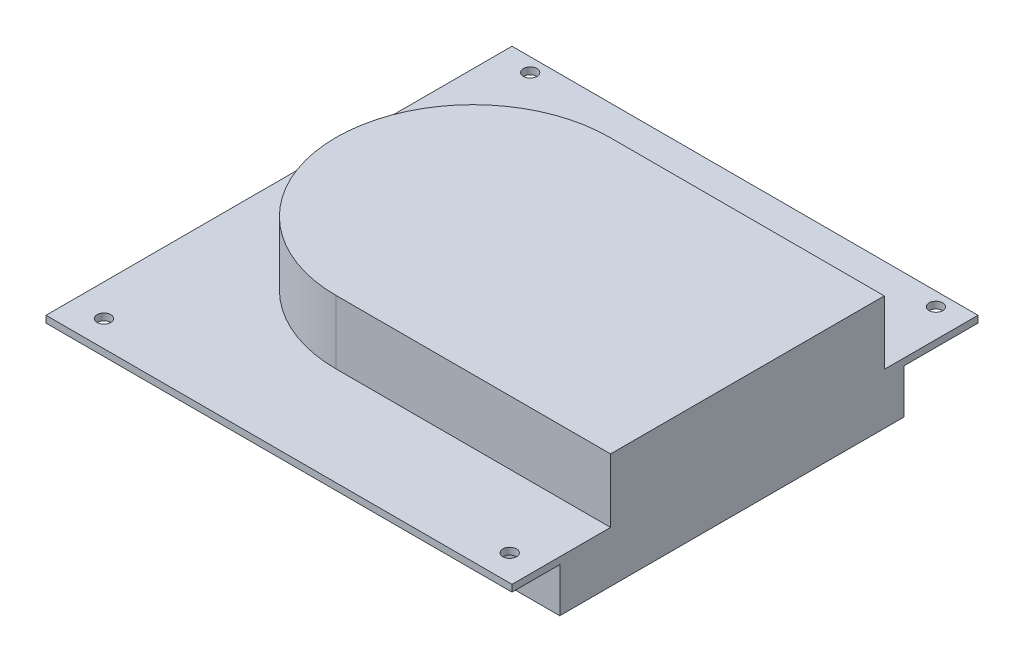
ISO-10303-21;
HEADER;
FILE_DESCRIPTION(('STEP AP214'),'2;1');
FILE_NAME('part.step','',(''),(''),'','','');
FILE_SCHEMA(('AUTOMOTIVE_DESIGN { 1 0 10303 214 1 1 1 1 }'));
ENDSEC;
DATA;
#1=APPLICATION_CONTEXT('core data for automotive mechanical design processes');
#2=APPLICATION_PROTOCOL_DEFINITION('international standard','automotive_design',2000,#1);
#3=PRODUCT_CONTEXT('',#1,'mechanical');
#4=PRODUCT('Part','Part','',(#3));
#5=PRODUCT_RELATED_PRODUCT_CATEGORY('part','',(#4));
#6=PRODUCT_DEFINITION_FORMATION('','',#4);
#7=PRODUCT_DEFINITION_CONTEXT('part definition',#1,'design');
#8=PRODUCT_DEFINITION('design','',#6,#7);
#9=PRODUCT_DEFINITION_SHAPE('','',#8);
#10=(LENGTH_UNIT() NAMED_UNIT(*) SI_UNIT(.MILLI.,.METRE.));
#11=(NAMED_UNIT(*) PLANE_ANGLE_UNIT() SI_UNIT($,.RADIAN.));
#12=(NAMED_UNIT(*) SI_UNIT($,.STERADIAN.) SOLID_ANGLE_UNIT());
#13=UNCERTAINTY_MEASURE_WITH_UNIT(LENGTH_MEASURE(1.E-05),#10,'distance_accuracy_value','');
#14=(GEOMETRIC_REPRESENTATION_CONTEXT(3) GLOBAL_UNCERTAINTY_ASSIGNED_CONTEXT((#13)) GLOBAL_UNIT_ASSIGNED_CONTEXT((#10,
#11,#12)) REPRESENTATION_CONTEXT('',''));
#15=CARTESIAN_POINT('',(0.,0.,0.));
#16=DIRECTION('',(0.,0.,1.));
#17=DIRECTION('',(1.,0.,0.));
#18=AXIS2_PLACEMENT_3D('',#15,#16,#17);
#19=CARTESIAN_POINT('',(0.,0.,0.));
#20=DIRECTION('',(0.,-1.,0.));
#21=DIRECTION('',(0.,0.,-1.));
#22=AXIS2_PLACEMENT_3D('',#19,#20,#21);
#23=PLANE('',#22);
#24=CARTESIAN_POINT('',(7.112,0.,-5.842));
#25=DIRECTION('',(0.,1.,0.));
#26=DIRECTION('',(0.,0.,1.));
#27=AXIS2_PLACEMENT_3D('',#24,#25,#26);
#28=CIRCLE('',#27,1.524);
#29=CARTESIAN_POINT('',(7.112,0.,-4.318));
#30=VERTEX_POINT('',#29);
#31=EDGE_CURVE('E237',#30,#30,#28,.T.);
#32=ORIENTED_EDGE('',*,*,#31,.T.);
#33=EDGE_LOOP('',(#32));
#34=FACE_BOUND('',#33,.T.);
#35=CARTESIAN_POINT('',(7.11200000000001,0.,-101.092));
#36=DIRECTION('',(0.,1.,0.));
#37=DIRECTION('',(0.,0.,1.));
#38=AXIS2_PLACEMENT_3D('',#35,#36,#37);
#39=CIRCLE('',#38,1.524);
#40=CARTESIAN_POINT('',(7.11200000000001,0.,-99.568));
#41=VERTEX_POINT('',#40);
#42=EDGE_CURVE('E249',#41,#41,#39,.T.);
#43=ORIENTED_EDGE('',*,*,#42,.T.);
#44=EDGE_LOOP('',(#43));
#45=FACE_BOUND('',#44,.T.);
#46=CARTESIAN_POINT('',(97.79,0.,-101.092));
#47=DIRECTION('',(0.,1.,0.));
#48=DIRECTION('',(0.,0.,1.));
#49=AXIS2_PLACEMENT_3D('',#46,#47,#48);
#50=CIRCLE('',#49,1.52399999999999);
#51=CARTESIAN_POINT('',(97.79,0.,-99.568));
#52=VERTEX_POINT('',#51);
#53=EDGE_CURVE('E243',#52,#52,#50,.T.);
#54=ORIENTED_EDGE('',*,*,#53,.T.);
#55=EDGE_LOOP('',(#54));
#56=FACE_BOUND('',#55,.T.);
#57=CARTESIAN_POINT('',(97.79,0.,-5.842));
#58=DIRECTION('',(0.,1.,0.));
#59=DIRECTION('',(0.,0.,1.));
#60=AXIS2_PLACEMENT_3D('',#57,#58,#59);
#61=CIRCLE('',#60,1.52399999999999);
#62=CARTESIAN_POINT('',(97.79,0.,-4.31800000000001));
#63=VERTEX_POINT('',#62);
#64=EDGE_CURVE('E233',#63,#63,#61,.T.);
#65=ORIENTED_EDGE('',*,*,#64,.T.);
#66=EDGE_LOOP('',(#65));
#67=FACE_BOUND('',#66,.T.);
#68=DIRECTION('',(0.,0.,1.));
#69=VECTOR('',#68,1.);
#70=CARTESIAN_POINT('',(17.1398172693102,0.,-73.9756008703694));
#71=LINE('',#70,#69);
#72=CARTESIAN_POINT('',(17.1398172693102,0.,-73.9756008703694));
#73=VERTEX_POINT('',#72);
#74=CARTESIAN_POINT('',(17.1398172693102,0.,-22.3799697720892));
#75=VERTEX_POINT('',#74);
#76=EDGE_CURVE('E341',#73,#75,#71,.T.);
#77=ORIENTED_EDGE('',*,*,#76,.F.);
#78=DIRECTION('',(1.,0.,0.));
#79=VECTOR('',#78,1.);
#80=CARTESIAN_POINT('',(0.,0.,-73.9756008703694));
#81=LINE('',#80,#79);
#82=CARTESIAN_POINT('',(0.,0.,-73.9756008703694));
#83=VERTEX_POINT('',#82);
#84=EDGE_CURVE('E345',#83,#73,#81,.T.);
#85=ORIENTED_EDGE('',*,*,#84,.F.);
#86=DIRECTION('',(0.,0.,1.));
#87=VECTOR('',#86,1.);
#88=CARTESIAN_POINT('',(0.,0.,0.));
#89=LINE('',#88,#87);
#90=CARTESIAN_POINT('',(0.,0.,-104.14));
#91=VERTEX_POINT('',#90);
#92=EDGE_CURVE('E170',#91,#83,#89,.T.);
#93=ORIENTED_EDGE('',*,*,#92,.F.);
#94=DIRECTION('',(-1.,0.,0.));
#95=VECTOR('',#94,1.);
#96=CARTESIAN_POINT('',(0.,0.,-104.14));
#97=LINE('',#96,#95);
#98=CARTESIAN_POINT('',(104.14,0.,-104.14));
#99=VERTEX_POINT('',#98);
#100=EDGE_CURVE('E262',#99,#91,#97,.T.);
#101=ORIENTED_EDGE('',*,*,#100,.F.);
#102=DIRECTION('',(0.,0.,-1.));
#103=VECTOR('',#102,1.);
#104=CARTESIAN_POINT('',(104.14,0.,0.));
#105=LINE('',#104,#103);
#106=CARTESIAN_POINT('',(104.14,0.,-87.5501635642877));
#107=VERTEX_POINT('',#106);
#108=EDGE_CURVE('E273',#107,#99,#105,.T.);
#109=ORIENTED_EDGE('',*,*,#108,.F.);
#110=DIRECTION('',(1.,0.,0.));
#111=VECTOR('',#110,1.);
#112=CARTESIAN_POINT('',(104.14,0.,-87.5501635642877));
#113=LINE('',#112,#111);
#114=CARTESIAN_POINT('',(86.0037896974859,0.,-87.5501635642877));
#115=VERTEX_POINT('',#114);
#116=EDGE_CURVE('E59',#115,#107,#113,.T.);
#117=ORIENTED_EDGE('',*,*,#116,.F.);
#118=DIRECTION('',(0.,0.,-1.));
#119=VECTOR('',#118,1.);
#120=CARTESIAN_POINT('',(86.0037896974859,0.,-87.5501635642877));
#121=LINE('',#120,#119);
#122=CARTESIAN_POINT('',(86.0037896974859,0.,-10.6770262588043));
#123=VERTEX_POINT('',#122);
#124=EDGE_CURVE('E174',#123,#115,#121,.T.);
#125=ORIENTED_EDGE('',*,*,#124,.F.);
#126=DIRECTION('',(-1.,0.,0.));
#127=VECTOR('',#126,1.);
#128=CARTESIAN_POINT('',(104.14,0.,-10.6770262588043));
#129=LINE('',#128,#127);
#130=CARTESIAN_POINT('',(104.14,0.,-10.6770262588043));
#131=VERTEX_POINT('',#130);
#132=EDGE_CURVE('E171',#131,#123,#129,.T.);
#133=ORIENTED_EDGE('',*,*,#132,.F.);
#134=CARTESIAN_POINT('',(104.14,0.,0.));
#135=VERTEX_POINT('',#134);
#136=EDGE_CURVE('E274',#135,#131,#105,.T.);
#137=ORIENTED_EDGE('',*,*,#136,.F.);
#138=DIRECTION('',(1.,0.,0.));
#139=VECTOR('',#138,1.);
#140=CARTESIAN_POINT('',(0.,0.,0.));
#141=LINE('',#140,#139);
#142=CARTESIAN_POINT('',(0.,0.,0.));
#143=VERTEX_POINT('',#142);
#144=EDGE_CURVE('E271',#143,#135,#141,.T.);
#145=ORIENTED_EDGE('',*,*,#144,.F.);
#146=CARTESIAN_POINT('',(0.,0.,-22.3799697720892));
#147=VERTEX_POINT('',#146);
#148=EDGE_CURVE('E255',#147,#143,#89,.T.);
#149=ORIENTED_EDGE('',*,*,#148,.F.);
#150=DIRECTION('',(-1.,0.,0.));
#151=VECTOR('',#150,1.);
#152=CARTESIAN_POINT('',(0.,0.,-22.3799697720892));
#153=LINE('',#152,#151);
#154=EDGE_CURVE('E165',#75,#147,#153,.T.);
#155=ORIENTED_EDGE('',*,*,#154,.F.);
#156=EDGE_LOOP('',(#77,#85,#93,#101,#109,#117,#125,#133,#137,#145,#149,#155));
#157=FACE_BOUND('',#156,.T.);
#158=ADVANCED_FACE('F36',(#34,#45,#56,#67,#157),#23,.T.);
#159=CARTESIAN_POINT('',(0.,1.524,0.));
#160=DIRECTION('',(0.,-1.,0.));
#161=DIRECTION('',(0.,0.,-1.));
#162=AXIS2_PLACEMENT_3D('',#159,#160,#161);
#163=PLANE('',#162);
#164=DIRECTION('',(-1.,0.,0.));
#165=VECTOR('',#164,1.);
#166=CARTESIAN_POINT('',(0.,1.524,-83.1978196974887));
#167=LINE('',#166,#165);
#168=CARTESIAN_POINT('',(104.14,1.524,-83.1978196974887));
#169=VERTEX_POINT('',#168);
#170=CARTESIAN_POINT('',(42.7986441187613,1.524,-83.1978196974887));
#171=VERTEX_POINT('',#170);
#172=EDGE_CURVE('E203',#169,#171,#167,.T.);
#173=ORIENTED_EDGE('',*,*,#172,.F.);
#174=DIRECTION('',(0.,0.,-1.));
#175=VECTOR('',#174,1.);
#176=CARTESIAN_POINT('',(104.14,1.524,0.));
#177=LINE('',#176,#175);
#178=CARTESIAN_POINT('',(104.14,1.524,-104.14));
#179=VERTEX_POINT('',#178);
#180=EDGE_CURVE('E264',#169,#179,#177,.T.);
#181=ORIENTED_EDGE('',*,*,#180,.T.);
#182=DIRECTION('',(-1.,0.,0.));
#183=VECTOR('',#182,1.);
#184=CARTESIAN_POINT('',(0.,1.524,-104.14));
#185=LINE('',#184,#183);
#186=CARTESIAN_POINT('',(0.,1.524,-104.14));
#187=VERTEX_POINT('',#186);
#188=EDGE_CURVE('E267',#179,#187,#185,.T.);
#189=ORIENTED_EDGE('',*,*,#188,.T.);
#190=DIRECTION('',(0.,0.,1.));
#191=VECTOR('',#190,1.);
#192=CARTESIAN_POINT('',(0.,1.524,0.));
#193=LINE('',#192,#191);
#194=CARTESIAN_POINT('',(0.,1.524,0.));
#195=VERTEX_POINT('',#194);
#196=EDGE_CURVE('E258',#187,#195,#193,.T.);
#197=ORIENTED_EDGE('',*,*,#196,.T.);
#198=DIRECTION('',(1.,0.,0.));
#199=VECTOR('',#198,1.);
#200=CARTESIAN_POINT('',(0.,1.524,0.));
#201=LINE('',#200,#199);
#202=CARTESIAN_POINT('',(104.14,1.524,0.));
#203=VERTEX_POINT('',#202);
#204=EDGE_CURVE('E261',#195,#203,#201,.T.);
#205=ORIENTED_EDGE('',*,*,#204,.T.);
#206=CARTESIAN_POINT('',(104.14,1.524,-22.0240341978979));
#207=VERTEX_POINT('',#206);
#208=EDGE_CURVE('E265',#203,#207,#177,.T.);
#209=ORIENTED_EDGE('',*,*,#208,.T.);
#210=DIRECTION('',(-1.,0.,0.));
#211=VECTOR('',#210,1.);
#212=CARTESIAN_POINT('',(0.,1.524,-22.0240341978979));
#213=LINE('',#212,#211);
#214=CARTESIAN_POINT('',(42.7986441187613,1.524,-22.0240341978979));
#215=VERTEX_POINT('',#214);
#216=EDGE_CURVE('E208',#207,#215,#213,.T.);
#217=ORIENTED_EDGE('',*,*,#216,.T.);
#218=CARTESIAN_POINT('',(42.7986441187613,1.524,-52.6109269476933));
#219=DIRECTION('',(0.,1.,0.));
#220=DIRECTION('',(0.,0.,1.));
#221=AXIS2_PLACEMENT_3D('',#218,#219,#220);
#222=CIRCLE('',#221,30.5868927497954);
#223=EDGE_CURVE('E218',#171,#215,#222,.T.);
#224=ORIENTED_EDGE('',*,*,#223,.F.);
#225=EDGE_LOOP('',(#173,#181,#189,#197,#205,#209,#217,#224));
#226=FACE_BOUND('',#225,.T.);
#227=CARTESIAN_POINT('',(7.11200000000001,1.524,-101.092));
#228=DIRECTION('',(0.,1.,0.));
#229=DIRECTION('',(0.,0.,1.));
#230=AXIS2_PLACEMENT_3D('',#227,#228,#229);
#231=CIRCLE('',#230,1.524);
#232=CARTESIAN_POINT('',(7.11200000000001,1.524,-99.568));
#233=VERTEX_POINT('',#232);
#234=EDGE_CURVE('E252',#233,#233,#231,.T.);
#235=ORIENTED_EDGE('',*,*,#234,.F.);
#236=EDGE_LOOP('',(#235));
#237=FACE_BOUND('',#236,.T.);
#238=CARTESIAN_POINT('',(97.79,1.524,-101.092));
#239=DIRECTION('',(0.,1.,0.));
#240=DIRECTION('',(0.,0.,1.));
#241=AXIS2_PLACEMENT_3D('',#238,#239,#240);
#242=CIRCLE('',#241,1.52399999999999);
#243=CARTESIAN_POINT('',(97.79,1.524,-99.568));
#244=VERTEX_POINT('',#243);
#245=EDGE_CURVE('E246',#244,#244,#242,.T.);
#246=ORIENTED_EDGE('',*,*,#245,.F.);
#247=EDGE_LOOP('',(#246));
#248=FACE_BOUND('',#247,.T.);
#249=CARTESIAN_POINT('',(7.112,1.524,-5.842));
#250=DIRECTION('',(0.,1.,0.));
#251=DIRECTION('',(0.,0.,1.));
#252=AXIS2_PLACEMENT_3D('',#249,#250,#251);
#253=CIRCLE('',#252,1.524);
#254=CARTESIAN_POINT('',(7.112,1.524,-4.318));
#255=VERTEX_POINT('',#254);
#256=EDGE_CURVE('E240',#255,#255,#253,.T.);
#257=ORIENTED_EDGE('',*,*,#256,.F.);
#258=EDGE_LOOP('',(#257));
#259=FACE_BOUND('',#258,.T.);
#260=CARTESIAN_POINT('',(97.79,1.524,-5.842));
#261=DIRECTION('',(0.,1.,0.));
#262=DIRECTION('',(0.,0.,1.));
#263=AXIS2_PLACEMENT_3D('',#260,#261,#262);
#264=CIRCLE('',#263,1.52399999999999);
#265=CARTESIAN_POINT('',(97.79,1.524,-4.31800000000001));
#266=VERTEX_POINT('',#265);
#267=EDGE_CURVE('E234',#266,#266,#264,.T.);
#268=ORIENTED_EDGE('',*,*,#267,.F.);
#269=EDGE_LOOP('',(#268));
#270=FACE_BOUND('',#269,.T.);
#271=ADVANCED_FACE('F316',(#226,#237,#248,#259,#270),#163,.F.);
#272=CARTESIAN_POINT('',(0.,1.524,0.));
#273=DIRECTION('',(1.,0.,0.));
#274=DIRECTION('',(0.,0.,-1.));
#275=AXIS2_PLACEMENT_3D('',#272,#273,#274);
#276=PLANE('',#275);
#277=ORIENTED_EDGE('',*,*,#92,.T.);
#278=DIRECTION('',(0.,1.,0.));
#279=VECTOR('',#278,1.);
#280=CARTESIAN_POINT('',(0.,-9.906,-73.9756008703694));
#281=LINE('',#280,#279);
#282=CARTESIAN_POINT('',(0.,-9.906,-73.9756008703694));
#283=VERTEX_POINT('',#282);
#284=EDGE_CURVE('E153',#283,#83,#281,.T.);
#285=ORIENTED_EDGE('',*,*,#284,.F.);
#286=DIRECTION('',(0.,0.,-1.));
#287=VECTOR('',#286,1.);
#288=CARTESIAN_POINT('',(0.,-9.906,-73.9756008703694));
#289=LINE('',#288,#287);
#290=CARTESIAN_POINT('',(0.,-9.906,-22.3799697720892));
#291=VERTEX_POINT('',#290);
#292=EDGE_CURVE('E160',#291,#283,#289,.T.);
#293=ORIENTED_EDGE('',*,*,#292,.F.);
#294=DIRECTION('',(0.,1.,0.));
#295=VECTOR('',#294,1.);
#296=CARTESIAN_POINT('',(0.,-9.906,-22.3799697720892));
#297=LINE('',#296,#295);
#298=EDGE_CURVE('E51',#291,#147,#297,.T.);
#299=ORIENTED_EDGE('',*,*,#298,.T.);
#300=ORIENTED_EDGE('',*,*,#148,.T.);
#301=DIRECTION('',(0.,-1.,0.));
#302=VECTOR('',#301,1.);
#303=CARTESIAN_POINT('',(0.,1.524,0.));
#304=LINE('',#303,#302);
#305=EDGE_CURVE('E11',#195,#143,#304,.T.);
#306=ORIENTED_EDGE('',*,*,#305,.F.);
#307=ORIENTED_EDGE('',*,*,#196,.F.);
#308=DIRECTION('',(0.,-1.,0.));
#309=VECTOR('',#308,1.);
#310=CARTESIAN_POINT('',(0.,1.524,-104.14));
#311=LINE('',#310,#309);
#312=EDGE_CURVE('E269',#187,#91,#311,.T.);
#313=ORIENTED_EDGE('',*,*,#312,.T.);
#314=EDGE_LOOP('',(#277,#285,#293,#299,#300,#306,#307,#313));
#315=FACE_BOUND('',#314,.T.);
#316=ADVANCED_FACE('F38',(#315),#276,.F.);
#317=CARTESIAN_POINT('',(0.,1.524,0.));
#318=DIRECTION('',(0.,0.,-1.));
#319=DIRECTION('',(-1.,0.,0.));
#320=AXIS2_PLACEMENT_3D('',#317,#318,#319);
#321=PLANE('',#320);
#322=ORIENTED_EDGE('',*,*,#144,.T.);
#323=DIRECTION('',(0.,-1.,0.));
#324=VECTOR('',#323,1.);
#325=CARTESIAN_POINT('',(104.14,1.524,0.));
#326=LINE('',#325,#324);
#327=EDGE_CURVE('E44',#203,#135,#326,.T.);
#328=ORIENTED_EDGE('',*,*,#327,.F.);
#329=ORIENTED_EDGE('',*,*,#204,.F.);
#330=ORIENTED_EDGE('',*,*,#305,.T.);
#331=EDGE_LOOP('',(#322,#328,#329,#330));
#332=FACE_BOUND('',#331,.T.);
#333=ADVANCED_FACE('F333',(#332),#321,.F.);
#334=CARTESIAN_POINT('',(104.14,1.524,0.));
#335=DIRECTION('',(-1.,0.,0.));
#336=DIRECTION('',(0.,0.,1.));
#337=AXIS2_PLACEMENT_3D('',#334,#335,#336);
#338=PLANE('',#337);
#339=ORIENTED_EDGE('',*,*,#136,.T.);
#340=DIRECTION('',(0.,1.,0.));
#341=VECTOR('',#340,1.);
#342=CARTESIAN_POINT('',(104.14,-9.906,-10.6770262588043));
#343=LINE('',#342,#341);
#344=CARTESIAN_POINT('',(104.14,-9.906,-10.6770262588043));
#345=VERTEX_POINT('',#344);
#346=EDGE_CURVE('E200',#345,#131,#343,.T.);
#347=ORIENTED_EDGE('',*,*,#346,.F.);
#348=DIRECTION('',(0.,0.,1.));
#349=VECTOR('',#348,1.);
#350=CARTESIAN_POINT('',(104.14,-9.906,-87.5501635642877));
#351=LINE('',#350,#349);
#352=CARTESIAN_POINT('',(104.14,-9.906,-87.5501635642877));
#353=VERTEX_POINT('',#352);
#354=EDGE_CURVE('E180',#353,#345,#351,.T.);
#355=ORIENTED_EDGE('',*,*,#354,.F.);
#356=DIRECTION('',(0.,1.,0.));
#357=VECTOR('',#356,1.);
#358=CARTESIAN_POINT('',(104.14,-9.906,-87.5501635642877));
#359=LINE('',#358,#357);
#360=EDGE_CURVE('E188',#353,#107,#359,.T.);
#361=ORIENTED_EDGE('',*,*,#360,.T.);
#362=ORIENTED_EDGE('',*,*,#108,.T.);
#363=DIRECTION('',(0.,-1.,0.));
#364=VECTOR('',#363,1.);
#365=CARTESIAN_POINT('',(104.14,1.524,-104.14));
#366=LINE('',#365,#364);
#367=EDGE_CURVE('E279',#179,#99,#366,.T.);
#368=ORIENTED_EDGE('',*,*,#367,.F.);
#369=ORIENTED_EDGE('',*,*,#180,.F.);
#370=DIRECTION('',(0.,-1.,0.));
#371=VECTOR('',#370,1.);
#372=CARTESIAN_POINT('',(104.14,15.748,-83.1978196974887));
#373=LINE('',#372,#371);
#374=CARTESIAN_POINT('',(104.14,15.748,-83.1978196974887));
#375=VERTEX_POINT('',#374);
#376=EDGE_CURVE('E215',#375,#169,#373,.T.);
#377=ORIENTED_EDGE('',*,*,#376,.F.);
#378=DIRECTION('',(0.,0.,-1.));
#379=VECTOR('',#378,1.);
#380=CARTESIAN_POINT('',(104.14,15.748,0.));
#381=LINE('',#380,#379);
#382=CARTESIAN_POINT('',(104.14,15.748,-22.0240341978979));
#383=VERTEX_POINT('',#382);
#384=EDGE_CURVE('E213',#383,#375,#381,.T.);
#385=ORIENTED_EDGE('',*,*,#384,.F.);
#386=DIRECTION('',(0.,-1.,0.));
#387=VECTOR('',#386,1.);
#388=CARTESIAN_POINT('',(104.14,15.748,-22.0240341978979));
#389=LINE('',#388,#387);
#390=EDGE_CURVE('E224',#383,#207,#389,.T.);
#391=ORIENTED_EDGE('',*,*,#390,.T.);
#392=ORIENTED_EDGE('',*,*,#208,.F.);
#393=ORIENTED_EDGE('',*,*,#327,.T.);
#394=EDGE_LOOP('',(#339,#347,#355,#361,#362,#368,#369,#377,#385,#391,#392,#393));
#395=FACE_BOUND('',#394,.T.);
#396=ADVANCED_FACE('F286',(#395),#338,.F.);
#397=CARTESIAN_POINT('',(0.,1.524,-104.14));
#398=DIRECTION('',(0.,0.,1.));
#399=DIRECTION('',(1.,0.,0.));
#400=AXIS2_PLACEMENT_3D('',#397,#398,#399);
#401=PLANE('',#400);
#402=ORIENTED_EDGE('',*,*,#100,.T.);
#403=ORIENTED_EDGE('',*,*,#312,.F.);
#404=ORIENTED_EDGE('',*,*,#188,.F.);
#405=ORIENTED_EDGE('',*,*,#367,.T.);
#406=EDGE_LOOP('',(#402,#403,#404,#405));
#407=FACE_BOUND('',#406,.T.);
#408=ADVANCED_FACE('F327',(#407),#401,.F.);
#409=CARTESIAN_POINT('',(7.11200000000001,1.524,-101.092));
#410=DIRECTION('',(0.,-1.,0.));
#411=DIRECTION('',(0.,0.,-1.));
#412=AXIS2_PLACEMENT_3D('',#409,#410,#411);
#413=CYLINDRICAL_SURFACE('',#412,1.524);
#414=ORIENTED_EDGE('',*,*,#234,.T.);
#415=EDGE_LOOP('',(#414));
#416=FACE_BOUND('',#415,.T.);
#417=ORIENTED_EDGE('',*,*,#42,.F.);
#418=EDGE_LOOP('',(#417));
#419=FACE_BOUND('',#418,.T.);
#420=ADVANCED_FACE('F330',(#416,#419),#413,.F.);
#421=CARTESIAN_POINT('',(97.79,1.524,-101.092));
#422=DIRECTION('',(0.,-1.,0.));
#423=DIRECTION('',(0.,0.,-1.));
#424=AXIS2_PLACEMENT_3D('',#421,#422,#423);
#425=CYLINDRICAL_SURFACE('',#424,1.52399999999999);
#426=ORIENTED_EDGE('',*,*,#245,.T.);
#427=EDGE_LOOP('',(#426));
#428=FACE_BOUND('',#427,.T.);
#429=ORIENTED_EDGE('',*,*,#53,.F.);
#430=EDGE_LOOP('',(#429));
#431=FACE_BOUND('',#430,.T.);
#432=ADVANCED_FACE('F392',(#428,#431),#425,.F.);
#433=CARTESIAN_POINT('',(7.112,1.524,-5.842));
#434=DIRECTION('',(0.,-1.,0.));
#435=DIRECTION('',(0.,0.,-1.));
#436=AXIS2_PLACEMENT_3D('',#433,#434,#435);
#437=CYLINDRICAL_SURFACE('',#436,1.524);
#438=ORIENTED_EDGE('',*,*,#256,.T.);
#439=EDGE_LOOP('',(#438));
#440=FACE_BOUND('',#439,.T.);
#441=ORIENTED_EDGE('',*,*,#31,.F.);
#442=EDGE_LOOP('',(#441));
#443=FACE_BOUND('',#442,.T.);
#444=ADVANCED_FACE('F388',(#440,#443),#437,.F.);
#445=CARTESIAN_POINT('',(97.79,1.524,-5.842));
#446=DIRECTION('',(0.,-1.,0.));
#447=DIRECTION('',(0.,0.,-1.));
#448=AXIS2_PLACEMENT_3D('',#445,#446,#447);
#449=CYLINDRICAL_SURFACE('',#448,1.52399999999999);
#450=ORIENTED_EDGE('',*,*,#267,.T.);
#451=EDGE_LOOP('',(#450));
#452=FACE_BOUND('',#451,.T.);
#453=ORIENTED_EDGE('',*,*,#64,.F.);
#454=EDGE_LOOP('',(#453));
#455=FACE_BOUND('',#454,.T.);
#456=ADVANCED_FACE('F382',(#452,#455),#449,.F.);
#457=CARTESIAN_POINT('',(0.,15.748,-83.1978196974887));
#458=DIRECTION('',(0.,0.,1.));
#459=DIRECTION('',(1.,0.,0.));
#460=AXIS2_PLACEMENT_3D('',#457,#458,#459);
#461=PLANE('',#460);
#462=ORIENTED_EDGE('',*,*,#172,.T.);
#463=DIRECTION('',(0.,-1.,0.));
#464=VECTOR('',#463,1.);
#465=CARTESIAN_POINT('',(42.7986441187613,15.748,-83.1978196974887));
#466=LINE('',#465,#464);
#467=CARTESIAN_POINT('',(42.7986441187613,15.748,-83.1978196974887));
#468=VERTEX_POINT('',#467);
#469=EDGE_CURVE('E230',#468,#171,#466,.T.);
#470=ORIENTED_EDGE('',*,*,#469,.F.);
#471=DIRECTION('',(-1.,0.,0.));
#472=VECTOR('',#471,1.);
#473=CARTESIAN_POINT('',(0.,15.748,-83.1978196974887));
#474=LINE('',#473,#472);
#475=EDGE_CURVE('E204',#375,#468,#474,.T.);
#476=ORIENTED_EDGE('',*,*,#475,.F.);
#477=ORIENTED_EDGE('',*,*,#376,.T.);
#478=EDGE_LOOP('',(#462,#470,#476,#477));
#479=FACE_BOUND('',#478,.T.);
#480=ADVANCED_FACE('F363',(#479),#461,.F.);
#481=CARTESIAN_POINT('',(42.7986441187613,15.748,-52.6109269476933));
#482=DIRECTION('',(0.,-1.,0.));
#483=DIRECTION('',(0.,0.,-1.));
#484=AXIS2_PLACEMENT_3D('',#481,#482,#483);
#485=CYLINDRICAL_SURFACE('',#484,30.5868927497954);
#486=ORIENTED_EDGE('',*,*,#223,.T.);
#487=DIRECTION('',(0.,-1.,0.));
#488=VECTOR('',#487,1.);
#489=CARTESIAN_POINT('',(42.7986441187613,15.748,-22.0240341978979));
#490=LINE('',#489,#488);
#491=CARTESIAN_POINT('',(42.7986441187613,15.748,-22.0240341978979));
#492=VERTEX_POINT('',#491);
#493=EDGE_CURVE('E227',#492,#215,#490,.T.);
#494=ORIENTED_EDGE('',*,*,#493,.F.);
#495=CARTESIAN_POINT('',(42.7986441187613,15.748,-52.6109269476933));
#496=DIRECTION('',(0.,1.,0.));
#497=DIRECTION('',(0.,0.,1.));
#498=AXIS2_PLACEMENT_3D('',#495,#496,#497);
#499=CIRCLE('',#498,30.5868927497954);
#500=EDGE_CURVE('E207',#468,#492,#499,.T.);
#501=ORIENTED_EDGE('',*,*,#500,.F.);
#502=ORIENTED_EDGE('',*,*,#469,.T.);
#503=EDGE_LOOP('',(#486,#494,#501,#502));
#504=FACE_BOUND('',#503,.T.);
#505=ADVANCED_FACE('F374',(#504),#485,.T.);
#506=CARTESIAN_POINT('',(0.,15.748,-22.0240341978979));
#507=DIRECTION('',(0.,0.,1.));
#508=DIRECTION('',(1.,0.,0.));
#509=AXIS2_PLACEMENT_3D('',#506,#507,#508);
#510=PLANE('',#509);
#511=ORIENTED_EDGE('',*,*,#216,.F.);
#512=ORIENTED_EDGE('',*,*,#390,.F.);
#513=DIRECTION('',(-1.,0.,0.));
#514=VECTOR('',#513,1.);
#515=CARTESIAN_POINT('',(0.,15.748,-22.0240341978979));
#516=LINE('',#515,#514);
#517=EDGE_CURVE('E210',#383,#492,#516,.T.);
#518=ORIENTED_EDGE('',*,*,#517,.T.);
#519=ORIENTED_EDGE('',*,*,#493,.T.);
#520=EDGE_LOOP('',(#511,#512,#518,#519));
#521=FACE_BOUND('',#520,.T.);
#522=ADVANCED_FACE('F371',(#521),#510,.T.);
#523=CARTESIAN_POINT('',(0.,15.748,0.));
#524=DIRECTION('',(0.,1.,0.));
#525=DIRECTION('',(0.,0.,1.));
#526=AXIS2_PLACEMENT_3D('',#523,#524,#525);
#527=PLANE('',#526);
#528=ORIENTED_EDGE('',*,*,#475,.T.);
#529=ORIENTED_EDGE('',*,*,#500,.T.);
#530=ORIENTED_EDGE('',*,*,#517,.F.);
#531=ORIENTED_EDGE('',*,*,#384,.T.);
#532=EDGE_LOOP('',(#528,#529,#530,#531));
#533=FACE_BOUND('',#532,.T.);
#534=ADVANCED_FACE('F366',(#533),#527,.T.);
#535=CARTESIAN_POINT('',(104.14,-9.906,-10.6770262588043));
#536=DIRECTION('',(0.,0.,-1.));
#537=DIRECTION('',(-1.,0.,0.));
#538=AXIS2_PLACEMENT_3D('',#535,#536,#537);
#539=PLANE('',#538);
#540=ORIENTED_EDGE('',*,*,#132,.T.);
#541=DIRECTION('',(0.,1.,0.));
#542=VECTOR('',#541,1.);
#543=CARTESIAN_POINT('',(86.0037896974859,-9.906,-10.6770262588043));
#544=LINE('',#543,#542);
#545=CARTESIAN_POINT('',(86.0037896974859,-9.906,-10.6770262588043));
#546=VERTEX_POINT('',#545);
#547=EDGE_CURVE('E197',#546,#123,#544,.T.);
#548=ORIENTED_EDGE('',*,*,#547,.F.);
#549=DIRECTION('',(-1.,0.,0.));
#550=VECTOR('',#549,1.);
#551=CARTESIAN_POINT('',(104.14,-9.906,-10.6770262588043));
#552=LINE('',#551,#550);
#553=EDGE_CURVE('E183',#345,#546,#552,.T.);
#554=ORIENTED_EDGE('',*,*,#553,.F.);
#555=ORIENTED_EDGE('',*,*,#346,.T.);
#556=EDGE_LOOP('',(#540,#548,#554,#555));
#557=FACE_BOUND('',#556,.T.);
#558=ADVANCED_FACE('F294',(#557),#539,.F.);
#559=CARTESIAN_POINT('',(86.0037896974859,-9.906,-87.5501635642877));
#560=DIRECTION('',(1.,0.,0.));
#561=DIRECTION('',(0.,0.,-1.));
#562=AXIS2_PLACEMENT_3D('',#559,#560,#561);
#563=PLANE('',#562);
#564=ORIENTED_EDGE('',*,*,#124,.T.);
#565=DIRECTION('',(0.,1.,0.));
#566=VECTOR('',#565,1.);
#567=CARTESIAN_POINT('',(86.0037896974859,-9.906,-87.5501635642877));
#568=LINE('',#567,#566);
#569=CARTESIAN_POINT('',(86.0037896974859,-9.906,-87.5501635642877));
#570=VERTEX_POINT('',#569);
#571=EDGE_CURVE('E194',#570,#115,#568,.T.);
#572=ORIENTED_EDGE('',*,*,#571,.F.);
#573=DIRECTION('',(0.,0.,-1.));
#574=VECTOR('',#573,1.);
#575=CARTESIAN_POINT('',(86.0037896974859,-9.906,-87.5501635642877));
#576=LINE('',#575,#574);
#577=EDGE_CURVE('E185',#546,#570,#576,.T.);
#578=ORIENTED_EDGE('',*,*,#577,.F.);
#579=ORIENTED_EDGE('',*,*,#547,.T.);
#580=EDGE_LOOP('',(#564,#572,#578,#579));
#581=FACE_BOUND('',#580,.T.);
#582=ADVANCED_FACE('F297',(#581),#563,.F.);
#583=CARTESIAN_POINT('',(104.14,-9.906,-87.5501635642877));
#584=DIRECTION('',(0.,0.,1.));
#585=DIRECTION('',(1.,0.,0.));
#586=AXIS2_PLACEMENT_3D('',#583,#584,#585);
#587=PLANE('',#586);
#588=ORIENTED_EDGE('',*,*,#116,.T.);
#589=ORIENTED_EDGE('',*,*,#360,.F.);
#590=DIRECTION('',(1.,0.,0.));
#591=VECTOR('',#590,1.);
#592=CARTESIAN_POINT('',(104.14,-9.906,-87.5501635642877));
#593=LINE('',#592,#591);
#594=EDGE_CURVE('E187',#570,#353,#593,.T.);
#595=ORIENTED_EDGE('',*,*,#594,.F.);
#596=ORIENTED_EDGE('',*,*,#571,.T.);
#597=EDGE_LOOP('',(#588,#589,#595,#596));
#598=FACE_BOUND('',#597,.T.);
#599=ADVANCED_FACE('F306',(#598),#587,.F.);
#600=CARTESIAN_POINT('',(0.,-9.906,0.));
#601=DIRECTION('',(0.,-1.,0.));
#602=DIRECTION('',(0.,0.,-1.));
#603=AXIS2_PLACEMENT_3D('',#600,#601,#602);
#604=PLANE('',#603);
#605=ORIENTED_EDGE('',*,*,#354,.T.);
#606=ORIENTED_EDGE('',*,*,#553,.T.);
#607=ORIENTED_EDGE('',*,*,#577,.T.);
#608=ORIENTED_EDGE('',*,*,#594,.T.);
#609=EDGE_LOOP('',(#605,#606,#607,#608));
#610=FACE_BOUND('',#609,.T.);
#611=ADVANCED_FACE('F301',(#610),#604,.T.);
#612=CARTESIAN_POINT('',(0.,-9.906,-73.9756008703694));
#613=DIRECTION('',(0.,0.,1.));
#614=DIRECTION('',(1.,0.,0.));
#615=AXIS2_PLACEMENT_3D('',#612,#613,#614);
#616=PLANE('',#615);
#617=ORIENTED_EDGE('',*,*,#84,.T.);
#618=DIRECTION('',(0.,1.,0.));
#619=VECTOR('',#618,1.);
#620=CARTESIAN_POINT('',(17.1398172693102,-9.906,-73.9756008703694));
#621=LINE('',#620,#619);
#622=CARTESIAN_POINT('',(17.1398172693102,-9.906,-73.9756008703694));
#623=VERTEX_POINT('',#622);
#624=EDGE_CURVE('E156',#623,#73,#621,.T.);
#625=ORIENTED_EDGE('',*,*,#624,.F.);
#626=DIRECTION('',(1.,0.,0.));
#627=VECTOR('',#626,1.);
#628=CARTESIAN_POINT('',(0.,-9.906,-73.9756008703694));
#629=LINE('',#628,#627);
#630=EDGE_CURVE('E149',#283,#623,#629,.T.);
#631=ORIENTED_EDGE('',*,*,#630,.F.);
#632=ORIENTED_EDGE('',*,*,#284,.T.);
#633=EDGE_LOOP('',(#617,#625,#631,#632));
#634=FACE_BOUND('',#633,.T.);
#635=ADVANCED_FACE('F151',(#634),#616,.F.);
#636=CARTESIAN_POINT('',(17.1398172693102,-9.906,-73.9756008703694));
#637=DIRECTION('',(-1.,0.,0.));
#638=DIRECTION('',(0.,0.,1.));
#639=AXIS2_PLACEMENT_3D('',#636,#637,#638);
#640=PLANE('',#639);
#641=ORIENTED_EDGE('',*,*,#76,.T.);
#642=DIRECTION('',(0.,1.,0.));
#643=VECTOR('',#642,1.);
#644=CARTESIAN_POINT('',(17.1398172693102,-9.906,-22.3799697720892));
#645=LINE('',#644,#643);
#646=CARTESIAN_POINT('',(17.1398172693102,-9.906,-22.3799697720892));
#647=VERTEX_POINT('',#646);
#648=EDGE_CURVE('E176',#647,#75,#645,.T.);
#649=ORIENTED_EDGE('',*,*,#648,.F.);
#650=DIRECTION('',(0.,0.,1.));
#651=VECTOR('',#650,1.);
#652=CARTESIAN_POINT('',(17.1398172693102,-9.906,-73.9756008703694));
#653=LINE('',#652,#651);
#654=EDGE_CURVE('E159',#623,#647,#653,.T.);
#655=ORIENTED_EDGE('',*,*,#654,.F.);
#656=ORIENTED_EDGE('',*,*,#624,.T.);
#657=EDGE_LOOP('',(#641,#649,#655,#656));
#658=FACE_BOUND('',#657,.T.);
#659=ADVANCED_FACE('F352',(#658),#640,.F.);
#660=CARTESIAN_POINT('',(0.,-9.906,-22.3799697720892));
#661=DIRECTION('',(0.,0.,-1.));
#662=DIRECTION('',(-1.,0.,0.));
#663=AXIS2_PLACEMENT_3D('',#660,#661,#662);
#664=PLANE('',#663);
#665=ORIENTED_EDGE('',*,*,#154,.T.);
#666=ORIENTED_EDGE('',*,*,#298,.F.);
#667=DIRECTION('',(-1.,0.,0.));
#668=VECTOR('',#667,1.);
#669=CARTESIAN_POINT('',(0.,-9.906,-22.3799697720892));
#670=LINE('',#669,#668);
#671=EDGE_CURVE('E164',#647,#291,#670,.T.);
#672=ORIENTED_EDGE('',*,*,#671,.F.);
#673=ORIENTED_EDGE('',*,*,#648,.T.);
#674=EDGE_LOOP('',(#665,#666,#672,#673));
#675=FACE_BOUND('',#674,.T.);
#676=ADVANCED_FACE('F350',(#675),#664,.F.);
#677=CARTESIAN_POINT('',(0.,-9.906,0.));
#678=DIRECTION('',(0.,1.,0.));
#679=DIRECTION('',(0.,0.,1.));
#680=AXIS2_PLACEMENT_3D('',#677,#678,#679);
#681=PLANE('',#680);
#682=ORIENTED_EDGE('',*,*,#292,.T.);
#683=ORIENTED_EDGE('',*,*,#630,.T.);
#684=ORIENTED_EDGE('',*,*,#654,.T.);
#685=ORIENTED_EDGE('',*,*,#671,.T.);
#686=EDGE_LOOP('',(#682,#683,#684,#685));
#687=FACE_BOUND('',#686,.T.);
#688=ADVANCED_FACE('F162',(#687),#681,.F.);
#689=CLOSED_SHELL('',(#158,#271,#316,#333,#396,#408,#420,#432,#444,#456,#480,#505,#522,#534,
#558,#582,#599,#611,#635,#659,#676,#688));
#690=MANIFOLD_SOLID_BREP('B2',#689);
#691=ADVANCED_BREP_SHAPE_REPRESENTATION('',(#18,#690),#14);
#692=SHAPE_DEFINITION_REPRESENTATION(#9,#691);
ENDSEC;
END-ISO-10303-21;
